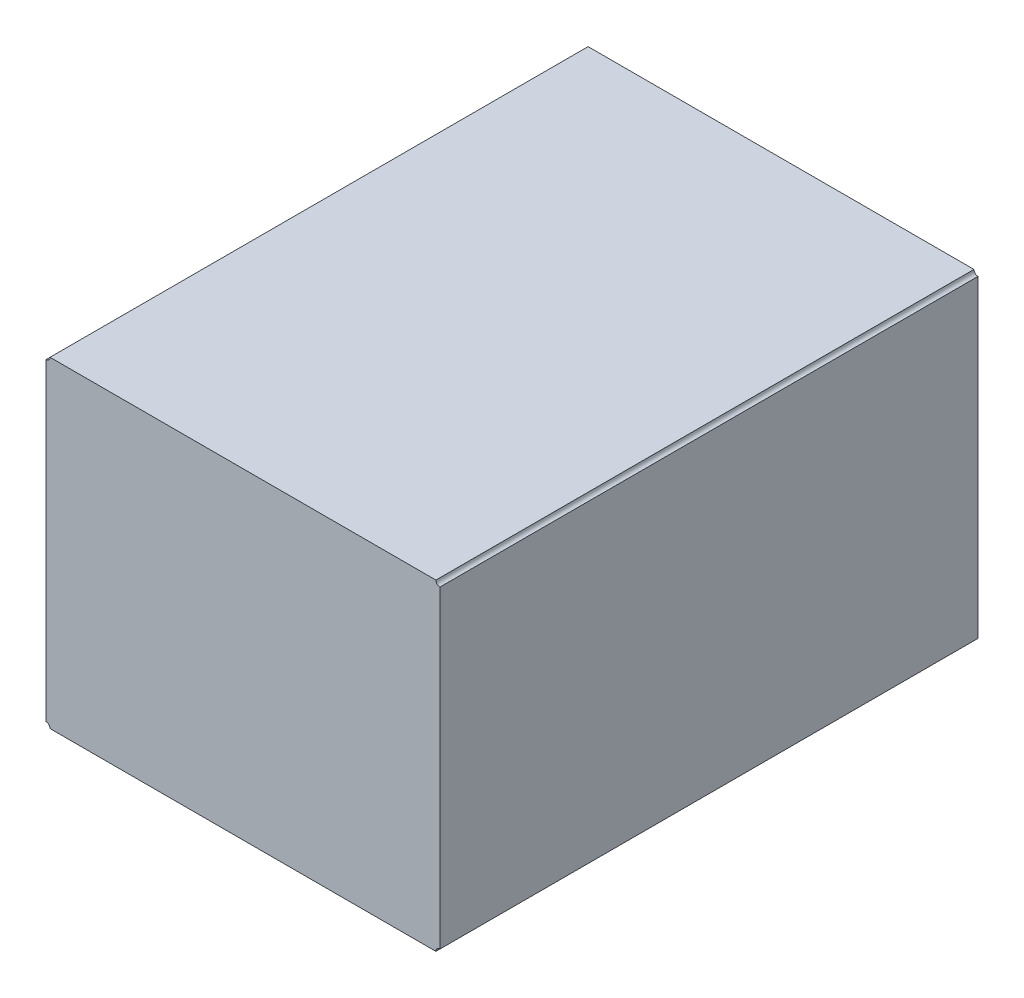
ISO-10303-21;
HEADER;
FILE_DESCRIPTION(('STEP AP214'),'2;1');
FILE_NAME('part.step','',(''),(''),'','','');
FILE_SCHEMA(('AUTOMOTIVE_DESIGN { 1 0 10303 214 1 1 1 1 }'));
ENDSEC;
DATA;
#1=APPLICATION_CONTEXT('core data for automotive mechanical design processes');
#2=APPLICATION_PROTOCOL_DEFINITION('international standard','automotive_design',2000,#1);
#3=PRODUCT_CONTEXT('',#1,'mechanical');
#4=PRODUCT('Part','Part','',(#3));
#5=PRODUCT_RELATED_PRODUCT_CATEGORY('part','',(#4));
#6=PRODUCT_DEFINITION_FORMATION('','',#4);
#7=PRODUCT_DEFINITION_CONTEXT('part definition',#1,'design');
#8=PRODUCT_DEFINITION('design','',#6,#7);
#9=PRODUCT_DEFINITION_SHAPE('','',#8);
#10=(LENGTH_UNIT() NAMED_UNIT(*) SI_UNIT(.MILLI.,.METRE.));
#11=(NAMED_UNIT(*) PLANE_ANGLE_UNIT() SI_UNIT($,.RADIAN.));
#12=(NAMED_UNIT(*) SI_UNIT($,.STERADIAN.) SOLID_ANGLE_UNIT());
#13=UNCERTAINTY_MEASURE_WITH_UNIT(LENGTH_MEASURE(1.E-05),#10,'distance_accuracy_value','');
#14=(GEOMETRIC_REPRESENTATION_CONTEXT(3) GLOBAL_UNCERTAINTY_ASSIGNED_CONTEXT((#13)) GLOBAL_UNIT_ASSIGNED_CONTEXT((#10,
#11,#12)) REPRESENTATION_CONTEXT('',''));
#15=CARTESIAN_POINT('',(0.,0.,0.));
#16=DIRECTION('',(0.,0.,1.));
#17=DIRECTION('',(1.,0.,0.));
#18=AXIS2_PLACEMENT_3D('',#15,#16,#17);
#19=CARTESIAN_POINT('',(91.186,90.424,8.5));
#20=DIRECTION('',(0.,0.,-1.));
#21=DIRECTION('',(-1.,0.,0.));
#22=AXIS2_PLACEMENT_3D('',#19,#20,#21);
#23=CYLINDRICAL_SURFACE('',#22,0.0634999999999941);
#24=CARTESIAN_POINT('',(91.186,90.424,0.));
#25=DIRECTION('',(0.,0.,1.));
#26=DIRECTION('',(1.,0.,0.));
#27=AXIS2_PLACEMENT_3D('',#24,#25,#26);
#28=CIRCLE('',#27,0.0634999999999941);
#29=CARTESIAN_POINT('',(91.186,90.3605,0.));
#30=VERTEX_POINT('',#29);
#31=CARTESIAN_POINT('',(91.2495,90.424,0.));
#32=VERTEX_POINT('',#31);
#33=EDGE_CURVE('E136',#30,#32,#28,.T.);
#34=ORIENTED_EDGE('',*,*,#33,.F.);
#35=DIRECTION('',(0.,0.,-1.));
#36=VECTOR('',#35,1.);
#37=CARTESIAN_POINT('',(91.186,90.3605,8.5));
#38=LINE('',#37,#36);
#39=CARTESIAN_POINT('',(91.186,90.3605,8.5));
#40=VERTEX_POINT('',#39);
#41=EDGE_CURVE('E11',#40,#30,#38,.T.);
#42=ORIENTED_EDGE('',*,*,#41,.F.);
#43=CARTESIAN_POINT('',(91.186,90.424,8.5));
#44=DIRECTION('',(0.,0.,1.));
#45=DIRECTION('',(1.,0.,0.));
#46=AXIS2_PLACEMENT_3D('',#43,#44,#45);
#47=CIRCLE('',#46,0.0634999999999941);
#48=CARTESIAN_POINT('',(91.2495,90.424,8.5));
#49=VERTEX_POINT('',#48);
#50=EDGE_CURVE('E164',#40,#49,#47,.T.);
#51=ORIENTED_EDGE('',*,*,#50,.T.);
#52=DIRECTION('',(0.,0.,-1.));
#53=VECTOR('',#52,1.);
#54=CARTESIAN_POINT('',(91.2495,90.424,8.5));
#55=LINE('',#54,#53);
#56=EDGE_CURVE('E56',#49,#32,#55,.T.);
#57=ORIENTED_EDGE('',*,*,#56,.T.);
#58=EDGE_LOOP('',(#34,#42,#51,#57));
#59=FACE_BOUND('',#58,.T.);
#60=ADVANCED_FACE('F39',(#59),#23,.F.);
#61=CARTESIAN_POINT('',(91.186,0.,8.5));
#62=DIRECTION('',(-1.,0.,0.));
#63=DIRECTION('',(0.,0.,1.));
#64=AXIS2_PLACEMENT_3D('',#61,#62,#63);
#65=PLANE('',#64);
#66=DIRECTION('',(0.,1.,0.));
#67=VECTOR('',#66,1.);
#68=CARTESIAN_POINT('',(91.186,0.,0.));
#69=LINE('',#68,#67);
#70=CARTESIAN_POINT('',(91.186,85.4075,0.));
#71=VERTEX_POINT('',#70);
#72=EDGE_CURVE('E139',#71,#30,#69,.T.);
#73=ORIENTED_EDGE('',*,*,#72,.F.);
#74=DIRECTION('',(0.,0.,-1.));
#75=VECTOR('',#74,1.);
#76=CARTESIAN_POINT('',(91.186,85.4075,8.5));
#77=LINE('',#76,#75);
#78=CARTESIAN_POINT('',(91.186,85.4075,8.5));
#79=VERTEX_POINT('',#78);
#80=EDGE_CURVE('E48',#79,#71,#77,.T.);
#81=ORIENTED_EDGE('',*,*,#80,.F.);
#82=DIRECTION('',(0.,1.,0.));
#83=VECTOR('',#82,1.);
#84=CARTESIAN_POINT('',(91.186,0.,8.5));
#85=LINE('',#84,#83);
#86=EDGE_CURVE('E199',#79,#40,#85,.T.);
#87=ORIENTED_EDGE('',*,*,#86,.T.);
#88=ORIENTED_EDGE('',*,*,#41,.T.);
#89=EDGE_LOOP('',(#73,#81,#87,#88));
#90=FACE_BOUND('',#89,.T.);
#91=ADVANCED_FACE('F187',(#90),#65,.T.);
#92=CARTESIAN_POINT('',(91.186,85.344,8.5));
#93=DIRECTION('',(0.,0.,-1.));
#94=DIRECTION('',(-1.,0.,0.));
#95=AXIS2_PLACEMENT_3D('',#92,#93,#94);
#96=CYLINDRICAL_SURFACE('',#95,0.0634999999999941);
#97=CARTESIAN_POINT('',(91.186,85.344,0.));
#98=DIRECTION('',(0.,0.,1.));
#99=DIRECTION('',(1.,0.,0.));
#100=AXIS2_PLACEMENT_3D('',#97,#98,#99);
#101=CIRCLE('',#100,0.0634999999999941);
#102=CARTESIAN_POINT('',(91.2495,85.344,0.));
#103=VERTEX_POINT('',#102);
#104=EDGE_CURVE('E143',#103,#71,#101,.T.);
#105=ORIENTED_EDGE('',*,*,#104,.F.);
#106=DIRECTION('',(0.,0.,-1.));
#107=VECTOR('',#106,1.);
#108=CARTESIAN_POINT('',(91.2495,85.344,8.5));
#109=LINE('',#108,#107);
#110=CARTESIAN_POINT('',(91.2495,85.344,8.5));
#111=VERTEX_POINT('',#110);
#112=EDGE_CURVE('E174',#111,#103,#109,.T.);
#113=ORIENTED_EDGE('',*,*,#112,.F.);
#114=CARTESIAN_POINT('',(91.186,85.344,8.5));
#115=DIRECTION('',(0.,0.,1.));
#116=DIRECTION('',(1.,0.,0.));
#117=AXIS2_PLACEMENT_3D('',#114,#115,#116);
#118=CIRCLE('',#117,0.0634999999999941);
#119=EDGE_CURVE('E183',#111,#79,#118,.T.);
#120=ORIENTED_EDGE('',*,*,#119,.T.);
#121=ORIENTED_EDGE('',*,*,#80,.T.);
#122=EDGE_LOOP('',(#105,#113,#120,#121));
#123=FACE_BOUND('',#122,.T.);
#124=ADVANCED_FACE('F181',(#123),#96,.F.);
#125=CARTESIAN_POINT('',(0.,85.344,8.5));
#126=DIRECTION('',(0.,1.,0.));
#127=DIRECTION('',(0.,0.,1.));
#128=AXIS2_PLACEMENT_3D('',#125,#126,#127);
#129=PLANE('',#128);
#130=DIRECTION('',(1.,0.,0.));
#131=VECTOR('',#130,1.);
#132=CARTESIAN_POINT('',(0.,85.344,0.));
#133=LINE('',#132,#131);
#134=CARTESIAN_POINT('',(97.3455,85.344,0.));
#135=VERTEX_POINT('',#134);
#136=EDGE_CURVE('E147',#103,#135,#133,.T.);
#137=ORIENTED_EDGE('',*,*,#136,.T.);
#138=DIRECTION('',(0.,0.,-1.));
#139=VECTOR('',#138,1.);
#140=CARTESIAN_POINT('',(97.3455,85.344,8.5));
#141=LINE('',#140,#139);
#142=CARTESIAN_POINT('',(97.3455,85.344,8.5));
#143=VERTEX_POINT('',#142);
#144=EDGE_CURVE('E171',#143,#135,#141,.T.);
#145=ORIENTED_EDGE('',*,*,#144,.F.);
#146=DIRECTION('',(1.,0.,0.));
#147=VECTOR('',#146,1.);
#148=CARTESIAN_POINT('',(0.,85.344,8.5));
#149=LINE('',#148,#147);
#150=EDGE_CURVE('E196',#111,#143,#149,.T.);
#151=ORIENTED_EDGE('',*,*,#150,.F.);
#152=ORIENTED_EDGE('',*,*,#112,.T.);
#153=EDGE_LOOP('',(#137,#145,#151,#152));
#154=FACE_BOUND('',#153,.T.);
#155=ADVANCED_FACE('F194',(#154),#129,.F.);
#156=CARTESIAN_POINT('',(97.409,85.344,8.5));
#157=DIRECTION('',(0.,0.,-1.));
#158=DIRECTION('',(-1.,0.,0.));
#159=AXIS2_PLACEMENT_3D('',#156,#157,#158);
#160=CYLINDRICAL_SURFACE('',#159,0.0634999999999941);
#161=CARTESIAN_POINT('',(97.409,85.344,0.));
#162=DIRECTION('',(0.,0.,1.));
#163=DIRECTION('',(1.,0.,0.));
#164=AXIS2_PLACEMENT_3D('',#161,#162,#163);
#165=CIRCLE('',#164,0.0634999999999941);
#166=CARTESIAN_POINT('',(97.409,85.4075,0.));
#167=VERTEX_POINT('',#166);
#168=EDGE_CURVE('E151',#167,#135,#165,.T.);
#169=ORIENTED_EDGE('',*,*,#168,.F.);
#170=DIRECTION('',(0.,0.,-1.));
#171=VECTOR('',#170,1.);
#172=CARTESIAN_POINT('',(97.409,85.4075,8.5));
#173=LINE('',#172,#171);
#174=CARTESIAN_POINT('',(97.409,85.4075,8.5));
#175=VERTEX_POINT('',#174);
#176=EDGE_CURVE('E126',#175,#167,#173,.T.);
#177=ORIENTED_EDGE('',*,*,#176,.F.);
#178=CARTESIAN_POINT('',(97.409,85.344,8.5));
#179=DIRECTION('',(0.,0.,1.));
#180=DIRECTION('',(1.,0.,0.));
#181=AXIS2_PLACEMENT_3D('',#178,#179,#180);
#182=CIRCLE('',#181,0.0634999999999941);
#183=EDGE_CURVE('E114',#175,#143,#182,.T.);
#184=ORIENTED_EDGE('',*,*,#183,.T.);
#185=ORIENTED_EDGE('',*,*,#144,.T.);
#186=EDGE_LOOP('',(#169,#177,#184,#185));
#187=FACE_BOUND('',#186,.T.);
#188=ADVANCED_FACE('F207',(#187),#160,.F.);
#189=CARTESIAN_POINT('',(97.409,0.,8.5));
#190=DIRECTION('',(-1.,0.,0.));
#191=DIRECTION('',(0.,0.,1.));
#192=AXIS2_PLACEMENT_3D('',#189,#190,#191);
#193=PLANE('',#192);
#194=DIRECTION('',(0.,1.,0.));
#195=VECTOR('',#194,1.);
#196=CARTESIAN_POINT('',(97.409,0.,0.));
#197=LINE('',#196,#195);
#198=CARTESIAN_POINT('',(97.409,90.3605,0.));
#199=VERTEX_POINT('',#198);
#200=EDGE_CURVE('E122',#167,#199,#197,.T.);
#201=ORIENTED_EDGE('',*,*,#200,.T.);
#202=DIRECTION('',(0.,0.,-1.));
#203=VECTOR('',#202,1.);
#204=CARTESIAN_POINT('',(97.409,90.3605,8.5));
#205=LINE('',#204,#203);
#206=CARTESIAN_POINT('',(97.409,90.3605,8.5));
#207=VERTEX_POINT('',#206);
#208=EDGE_CURVE('E119',#207,#199,#205,.T.);
#209=ORIENTED_EDGE('',*,*,#208,.F.);
#210=DIRECTION('',(0.,1.,0.));
#211=VECTOR('',#210,1.);
#212=CARTESIAN_POINT('',(97.409,0.,8.5));
#213=LINE('',#212,#211);
#214=EDGE_CURVE('E107',#175,#207,#213,.T.);
#215=ORIENTED_EDGE('',*,*,#214,.F.);
#216=ORIENTED_EDGE('',*,*,#176,.T.);
#217=EDGE_LOOP('',(#201,#209,#215,#216));
#218=FACE_BOUND('',#217,.T.);
#219=ADVANCED_FACE('F120',(#218),#193,.F.);
#220=CARTESIAN_POINT('',(97.409,90.424,8.5));
#221=DIRECTION('',(0.,0.,-1.));
#222=DIRECTION('',(-1.,0.,0.));
#223=AXIS2_PLACEMENT_3D('',#220,#221,#222);
#224=CYLINDRICAL_SURFACE('',#223,0.0634999999999941);
#225=CARTESIAN_POINT('',(97.409,90.424,0.));
#226=DIRECTION('',(0.,0.,1.));
#227=DIRECTION('',(1.,0.,0.));
#228=AXIS2_PLACEMENT_3D('',#225,#226,#227);
#229=CIRCLE('',#228,0.0634999999999941);
#230=CARTESIAN_POINT('',(97.3455,90.424,0.));
#231=VERTEX_POINT('',#230);
#232=EDGE_CURVE('E157',#231,#199,#229,.T.);
#233=ORIENTED_EDGE('',*,*,#232,.F.);
#234=DIRECTION('',(0.,0.,-1.));
#235=VECTOR('',#234,1.);
#236=CARTESIAN_POINT('',(97.3455,90.424,8.5));
#237=LINE('',#236,#235);
#238=CARTESIAN_POINT('',(97.3455,90.424,8.5));
#239=VERTEX_POINT('',#238);
#240=EDGE_CURVE('E81',#239,#231,#237,.T.);
#241=ORIENTED_EDGE('',*,*,#240,.F.);
#242=CARTESIAN_POINT('',(97.409,90.424,8.5));
#243=DIRECTION('',(0.,0.,1.));
#244=DIRECTION('',(1.,0.,0.));
#245=AXIS2_PLACEMENT_3D('',#242,#243,#244);
#246=CIRCLE('',#245,0.0634999999999941);
#247=EDGE_CURVE('E112',#239,#207,#246,.T.);
#248=ORIENTED_EDGE('',*,*,#247,.T.);
#249=ORIENTED_EDGE('',*,*,#208,.T.);
#250=EDGE_LOOP('',(#233,#241,#248,#249));
#251=FACE_BOUND('',#250,.T.);
#252=ADVANCED_FACE('F128',(#251),#224,.F.);
#253=CARTESIAN_POINT('',(0.,90.424,8.5));
#254=DIRECTION('',(0.,1.,0.));
#255=DIRECTION('',(0.,0.,1.));
#256=AXIS2_PLACEMENT_3D('',#253,#254,#255);
#257=PLANE('',#256);
#258=DIRECTION('',(1.,0.,0.));
#259=VECTOR('',#258,1.);
#260=CARTESIAN_POINT('',(0.,90.424,0.));
#261=LINE('',#260,#259);
#262=EDGE_CURVE('E160',#32,#231,#261,.T.);
#263=ORIENTED_EDGE('',*,*,#262,.F.);
#264=ORIENTED_EDGE('',*,*,#56,.F.);
#265=DIRECTION('',(1.,0.,0.));
#266=VECTOR('',#265,1.);
#267=CARTESIAN_POINT('',(0.,90.424,8.5));
#268=LINE('',#267,#266);
#269=EDGE_CURVE('E130',#49,#239,#268,.T.);
#270=ORIENTED_EDGE('',*,*,#269,.T.);
#271=ORIENTED_EDGE('',*,*,#240,.T.);
#272=EDGE_LOOP('',(#263,#264,#270,#271));
#273=FACE_BOUND('',#272,.T.);
#274=ADVANCED_FACE('F208',(#273),#257,.T.);
#275=CARTESIAN_POINT('',(0.,0.,8.5));
#276=DIRECTION('',(0.,0.,1.));
#277=DIRECTION('',(1.,0.,0.));
#278=AXIS2_PLACEMENT_3D('',#275,#276,#277);
#279=PLANE('',#278);
#280=ORIENTED_EDGE('',*,*,#50,.F.);
#281=ORIENTED_EDGE('',*,*,#86,.F.);
#282=ORIENTED_EDGE('',*,*,#119,.F.);
#283=ORIENTED_EDGE('',*,*,#150,.T.);
#284=ORIENTED_EDGE('',*,*,#183,.F.);
#285=ORIENTED_EDGE('',*,*,#214,.T.);
#286=ORIENTED_EDGE('',*,*,#247,.F.);
#287=ORIENTED_EDGE('',*,*,#269,.F.);
#288=EDGE_LOOP('',(#280,#281,#282,#283,#284,#285,#286,#287));
#289=FACE_BOUND('',#288,.T.);
#290=ADVANCED_FACE('F109',(#289),#279,.T.);
#291=CARTESIAN_POINT('',(0.,0.,0.));
#292=DIRECTION('',(0.,0.,1.));
#293=DIRECTION('',(1.,0.,0.));
#294=AXIS2_PLACEMENT_3D('',#291,#292,#293);
#295=PLANE('',#294);
#296=ORIENTED_EDGE('',*,*,#33,.T.);
#297=ORIENTED_EDGE('',*,*,#262,.T.);
#298=ORIENTED_EDGE('',*,*,#232,.T.);
#299=ORIENTED_EDGE('',*,*,#200,.F.);
#300=ORIENTED_EDGE('',*,*,#168,.T.);
#301=ORIENTED_EDGE('',*,*,#136,.F.);
#302=ORIENTED_EDGE('',*,*,#104,.T.);
#303=ORIENTED_EDGE('',*,*,#72,.T.);
#304=EDGE_LOOP('',(#296,#297,#298,#299,#300,#301,#302,#303));
#305=FACE_BOUND('',#304,.T.);
#306=ADVANCED_FACE('F190',(#305),#295,.F.);
#307=CLOSED_SHELL('',(#60,#91,#124,#155,#188,#219,#252,#274,#290,#306));
#308=MANIFOLD_SOLID_BREP('B2',#307);
#309=ADVANCED_BREP_SHAPE_REPRESENTATION('',(#18,#308),#14);
#310=SHAPE_DEFINITION_REPRESENTATION(#9,#309);
ENDSEC;
END-ISO-10303-21;
